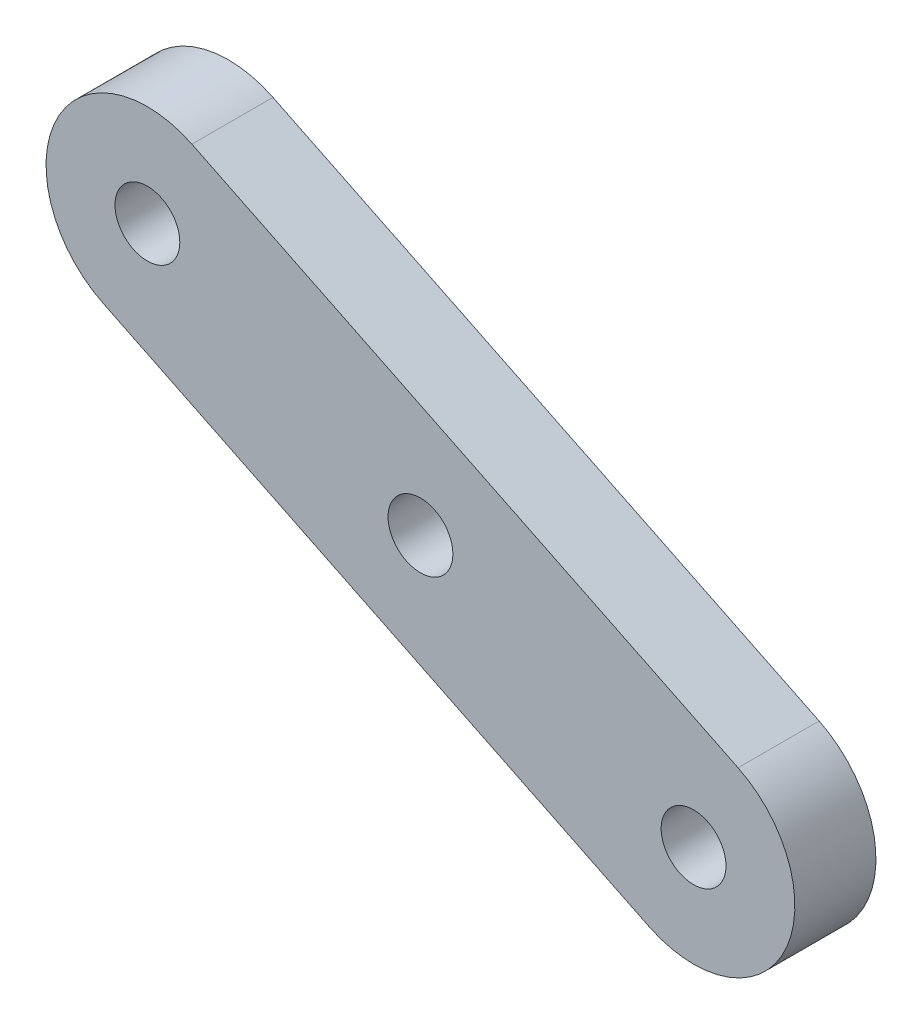
ISO-10303-21;
HEADER;
FILE_DESCRIPTION(('STEP AP214'),'2;1');
FILE_NAME('part.step','',(''),(''),'','','');
FILE_SCHEMA(('AUTOMOTIVE_DESIGN { 1 0 10303 214 1 1 1 1 }'));
ENDSEC;
DATA;
#1=APPLICATION_CONTEXT('core data for automotive mechanical design processes');
#2=APPLICATION_PROTOCOL_DEFINITION('international standard','automotive_design',2000,#1);
#3=PRODUCT_CONTEXT('',#1,'mechanical');
#4=PRODUCT('Part','Part','',(#3));
#5=PRODUCT_RELATED_PRODUCT_CATEGORY('part','',(#4));
#6=PRODUCT_DEFINITION_FORMATION('','',#4);
#7=PRODUCT_DEFINITION_CONTEXT('part definition',#1,'design');
#8=PRODUCT_DEFINITION('design','',#6,#7);
#9=PRODUCT_DEFINITION_SHAPE('','',#8);
#10=(LENGTH_UNIT() NAMED_UNIT(*) SI_UNIT(.MILLI.,.METRE.));
#11=(NAMED_UNIT(*) PLANE_ANGLE_UNIT() SI_UNIT($,.RADIAN.));
#12=(NAMED_UNIT(*) SI_UNIT($,.STERADIAN.) SOLID_ANGLE_UNIT());
#13=UNCERTAINTY_MEASURE_WITH_UNIT(LENGTH_MEASURE(1.E-05),#10,'distance_accuracy_value','');
#14=(GEOMETRIC_REPRESENTATION_CONTEXT(3) GLOBAL_UNCERTAINTY_ASSIGNED_CONTEXT((#13)) GLOBAL_UNIT_ASSIGNED_CONTEXT((#10,
#11,#12)) REPRESENTATION_CONTEXT('',''));
#15=CARTESIAN_POINT('',(0.,0.,0.));
#16=DIRECTION('',(0.,0.,1.));
#17=DIRECTION('',(1.,0.,0.));
#18=AXIS2_PLACEMENT_3D('',#15,#16,#17);
#19=CARTESIAN_POINT('',(0.,0.,4.));
#20=DIRECTION('',(0.,0.,1.));
#21=DIRECTION('',(1.,0.,0.));
#22=AXIS2_PLACEMENT_3D('',#19,#20,#21);
#23=PLANE('',#22);
#24=CARTESIAN_POINT('',(0.,0.,4.));
#25=DIRECTION('',(0.,0.,1.));
#26=DIRECTION('',(1.,0.,0.));
#27=AXIS2_PLACEMENT_3D('',#24,#25,#26);
#28=CIRCLE('',#27,1.6);
#29=CARTESIAN_POINT('',(1.60000000000001,0.,4.));
#30=VERTEX_POINT('',#29);
#31=EDGE_CURVE('E119',#30,#30,#28,.T.);
#32=ORIENTED_EDGE('',*,*,#31,.F.);
#33=EDGE_LOOP('',(#32));
#34=FACE_BOUND('',#33,.T.);
#35=CARTESIAN_POINT('',(0.,0.,4.));
#36=DIRECTION('',(0.,0.,1.));
#37=DIRECTION('',(1.,0.,0.));
#38=AXIS2_PLACEMENT_3D('',#35,#36,#37);
#39=CIRCLE('',#38,5.);
#40=CARTESIAN_POINT('',(-2.19568936266241,-4.4920984208598,4.));
#41=VERTEX_POINT('',#40);
#42=CARTESIAN_POINT('',(2.19568936266242,4.4920984208598,4.));
#43=VERTEX_POINT('',#42);
#44=EDGE_CURVE('E89',#41,#43,#39,.T.);
#45=ORIENTED_EDGE('',*,*,#44,.T.);
#46=DIRECTION('',(-0.89841968417196,0.439137872532483,0.));
#47=VECTOR('',#46,1.);
#48=CARTESIAN_POINT('',(2.19568936266242,4.4920984208598,4.));
#49=LINE('',#48,#47);
#50=CARTESIAN_POINT('',(-24.7569011624964,17.6662345968343,4.));
#51=VERTEX_POINT('',#50);
#52=EDGE_CURVE('E84',#43,#51,#49,.T.);
#53=ORIENTED_EDGE('',*,*,#52,.T.);
#54=CARTESIAN_POINT('',(-26.9525905251588,13.1741361759745,4.));
#55=DIRECTION('',(0.,0.,1.));
#56=DIRECTION('',(1.,0.,0.));
#57=AXIS2_PLACEMENT_3D('',#54,#55,#56);
#58=CIRCLE('',#57,5.);
#59=CARTESIAN_POINT('',(-29.1482798878212,8.68203775511468,4.));
#60=VERTEX_POINT('',#59);
#61=EDGE_CURVE('E87',#51,#60,#58,.T.);
#62=ORIENTED_EDGE('',*,*,#61,.T.);
#63=DIRECTION('',(0.89841968417196,-0.439137872532483,0.));
#64=VECTOR('',#63,1.);
#65=CARTESIAN_POINT('',(-2.19568936266241,-4.4920984208598,4.));
#66=LINE('',#65,#64);
#67=EDGE_CURVE('E54',#60,#41,#66,.T.);
#68=ORIENTED_EDGE('',*,*,#67,.T.);
#69=EDGE_LOOP('',(#45,#53,#62,#68));
#70=FACE_BOUND('',#69,.T.);
#71=CARTESIAN_POINT('',(-26.9525905251588,13.1741361759745,4.));
#72=DIRECTION('',(0.,0.,1.));
#73=DIRECTION('',(1.,0.,0.));
#74=AXIS2_PLACEMENT_3D('',#71,#72,#73);
#75=CIRCLE('',#74,1.6);
#76=CARTESIAN_POINT('',(-25.3525905251588,13.1741361759745,4.));
#77=VERTEX_POINT('',#76);
#78=EDGE_CURVE('E104',#77,#77,#75,.T.);
#79=ORIENTED_EDGE('',*,*,#78,.F.);
#80=EDGE_LOOP('',(#79));
#81=FACE_BOUND('',#80,.T.);
#82=CARTESIAN_POINT('',(-13.4762952625794,6.58706808798724,4.));
#83=DIRECTION('',(0.,0.,1.));
#84=DIRECTION('',(1.,0.,0.));
#85=AXIS2_PLACEMENT_3D('',#82,#83,#84);
#86=CIRCLE('',#85,1.6);
#87=CARTESIAN_POINT('',(-11.8762952625794,6.58706808798724,4.));
#88=VERTEX_POINT('',#87);
#89=EDGE_CURVE('E125',#88,#88,#86,.T.);
#90=ORIENTED_EDGE('',*,*,#89,.F.);
#91=EDGE_LOOP('',(#90));
#92=FACE_BOUND('',#91,.T.);
#93=ADVANCED_FACE('F37',(#34,#70,#81,#92),#23,.T.);
#94=CARTESIAN_POINT('',(0.,0.,0.));
#95=DIRECTION('',(0.,0.,1.));
#96=DIRECTION('',(1.,0.,0.));
#97=AXIS2_PLACEMENT_3D('',#94,#95,#96);
#98=PLANE('',#97);
#99=CARTESIAN_POINT('',(0.,0.,0.));
#100=DIRECTION('',(0.,0.,1.));
#101=DIRECTION('',(1.,0.,0.));
#102=AXIS2_PLACEMENT_3D('',#99,#100,#101);
#103=CIRCLE('',#102,5.);
#104=CARTESIAN_POINT('',(-2.19568936266241,-4.4920984208598,0.));
#105=VERTEX_POINT('',#104);
#106=CARTESIAN_POINT('',(2.19568936266242,4.4920984208598,0.));
#107=VERTEX_POINT('',#106);
#108=EDGE_CURVE('E101',#105,#107,#103,.T.);
#109=ORIENTED_EDGE('',*,*,#108,.F.);
#110=DIRECTION('',(0.89841968417196,-0.439137872532483,0.));
#111=VECTOR('',#110,1.);
#112=CARTESIAN_POINT('',(-2.19568936266241,-4.4920984208598,0.));
#113=LINE('',#112,#111);
#114=CARTESIAN_POINT('',(-29.1482798878212,8.68203775511468,0.));
#115=VERTEX_POINT('',#114);
#116=EDGE_CURVE('E77',#115,#105,#113,.T.);
#117=ORIENTED_EDGE('',*,*,#116,.F.);
#118=CARTESIAN_POINT('',(-26.9525905251588,13.1741361759745,0.));
#119=DIRECTION('',(0.,0.,1.));
#120=DIRECTION('',(1.,0.,0.));
#121=AXIS2_PLACEMENT_3D('',#118,#119,#120);
#122=CIRCLE('',#121,5.);
#123=CARTESIAN_POINT('',(-24.7569011624964,17.6662345968343,0.));
#124=VERTEX_POINT('',#123);
#125=EDGE_CURVE('E71',#124,#115,#122,.T.);
#126=ORIENTED_EDGE('',*,*,#125,.F.);
#127=DIRECTION('',(-0.89841968417196,0.439137872532483,0.));
#128=VECTOR('',#127,1.);
#129=CARTESIAN_POINT('',(2.19568936266242,4.4920984208598,0.));
#130=LINE('',#129,#128);
#131=EDGE_CURVE('E93',#107,#124,#130,.T.);
#132=ORIENTED_EDGE('',*,*,#131,.F.);
#133=EDGE_LOOP('',(#109,#117,#126,#132));
#134=FACE_BOUND('',#133,.T.);
#135=CARTESIAN_POINT('',(-26.9525905251588,13.1741361759745,0.));
#136=DIRECTION('',(0.,0.,1.));
#137=DIRECTION('',(1.,0.,0.));
#138=AXIS2_PLACEMENT_3D('',#135,#136,#137);
#139=CIRCLE('',#138,1.6);
#140=CARTESIAN_POINT('',(-25.3525905251588,13.1741361759745,0.));
#141=VERTEX_POINT('',#140);
#142=EDGE_CURVE('E116',#141,#141,#139,.T.);
#143=ORIENTED_EDGE('',*,*,#142,.T.);
#144=EDGE_LOOP('',(#143));
#145=FACE_BOUND('',#144,.T.);
#146=CARTESIAN_POINT('',(0.,0.,0.));
#147=DIRECTION('',(0.,0.,1.));
#148=DIRECTION('',(1.,0.,0.));
#149=AXIS2_PLACEMENT_3D('',#146,#147,#148);
#150=CIRCLE('',#149,1.6);
#151=CARTESIAN_POINT('',(1.60000000000001,0.,0.));
#152=VERTEX_POINT('',#151);
#153=EDGE_CURVE('E122',#152,#152,#150,.T.);
#154=ORIENTED_EDGE('',*,*,#153,.T.);
#155=EDGE_LOOP('',(#154));
#156=FACE_BOUND('',#155,.T.);
#157=CARTESIAN_POINT('',(-13.4762952625794,6.58706808798724,0.));
#158=DIRECTION('',(0.,0.,1.));
#159=DIRECTION('',(1.,0.,0.));
#160=AXIS2_PLACEMENT_3D('',#157,#158,#159);
#161=CIRCLE('',#160,1.6);
#162=CARTESIAN_POINT('',(-11.8762952625794,6.58706808798724,0.));
#163=VERTEX_POINT('',#162);
#164=EDGE_CURVE('E128',#163,#163,#161,.T.);
#165=ORIENTED_EDGE('',*,*,#164,.T.);
#166=EDGE_LOOP('',(#165));
#167=FACE_BOUND('',#166,.T.);
#168=ADVANCED_FACE('F112',(#134,#145,#156,#167),#98,.F.);
#169=CARTESIAN_POINT('',(0.,0.,4.));
#170=DIRECTION('',(0.,0.,-1.));
#171=DIRECTION('',(-1.,0.,0.));
#172=AXIS2_PLACEMENT_3D('',#169,#170,#171);
#173=CYLINDRICAL_SURFACE('',#172,5.);
#174=ORIENTED_EDGE('',*,*,#108,.T.);
#175=DIRECTION('',(0.,0.,-1.));
#176=VECTOR('',#175,1.);
#177=CARTESIAN_POINT('',(2.19568936266242,4.4920984208598,4.));
#178=LINE('',#177,#176);
#179=EDGE_CURVE('E11',#43,#107,#178,.T.);
#180=ORIENTED_EDGE('',*,*,#179,.F.);
#181=ORIENTED_EDGE('',*,*,#44,.F.);
#182=DIRECTION('',(0.,0.,-1.));
#183=VECTOR('',#182,1.);
#184=CARTESIAN_POINT('',(-2.19568936266241,-4.4920984208598,4.));
#185=LINE('',#184,#183);
#186=EDGE_CURVE('E97',#41,#105,#185,.T.);
#187=ORIENTED_EDGE('',*,*,#186,.T.);
#188=EDGE_LOOP('',(#174,#180,#181,#187));
#189=FACE_BOUND('',#188,.T.);
#190=ADVANCED_FACE('F39',(#189),#173,.T.);
#191=CARTESIAN_POINT('',(2.19568936266242,4.4920984208598,4.));
#192=DIRECTION('',(-0.439137872532483,-0.89841968417196,0.));
#193=DIRECTION('',(0.89841968417196,-0.439137872532483,0.));
#194=AXIS2_PLACEMENT_3D('',#191,#192,#193);
#195=PLANE('',#194);
#196=ORIENTED_EDGE('',*,*,#131,.T.);
#197=DIRECTION('',(0.,0.,-1.));
#198=VECTOR('',#197,1.);
#199=CARTESIAN_POINT('',(-24.7569011624964,17.6662345968343,4.));
#200=LINE('',#199,#198);
#201=EDGE_CURVE('E46',#51,#124,#200,.T.);
#202=ORIENTED_EDGE('',*,*,#201,.F.);
#203=ORIENTED_EDGE('',*,*,#52,.F.);
#204=ORIENTED_EDGE('',*,*,#179,.T.);
#205=EDGE_LOOP('',(#196,#202,#203,#204));
#206=FACE_BOUND('',#205,.T.);
#207=ADVANCED_FACE('F92',(#206),#195,.F.);
#208=CARTESIAN_POINT('',(-26.9525905251588,13.1741361759745,4.));
#209=DIRECTION('',(0.,0.,-1.));
#210=DIRECTION('',(-1.,0.,0.));
#211=AXIS2_PLACEMENT_3D('',#208,#209,#210);
#212=CYLINDRICAL_SURFACE('',#211,5.);
#213=ORIENTED_EDGE('',*,*,#125,.T.);
#214=DIRECTION('',(0.,0.,-1.));
#215=VECTOR('',#214,1.);
#216=CARTESIAN_POINT('',(-29.1482798878212,8.68203775511468,4.));
#217=LINE('',#216,#215);
#218=EDGE_CURVE('E94',#60,#115,#217,.T.);
#219=ORIENTED_EDGE('',*,*,#218,.F.);
#220=ORIENTED_EDGE('',*,*,#61,.F.);
#221=ORIENTED_EDGE('',*,*,#201,.T.);
#222=EDGE_LOOP('',(#213,#219,#220,#221));
#223=FACE_BOUND('',#222,.T.);
#224=ADVANCED_FACE('F95',(#223),#212,.T.);
#225=CARTESIAN_POINT('',(-2.19568936266241,-4.4920984208598,4.));
#226=DIRECTION('',(0.439137872532483,0.89841968417196,0.));
#227=DIRECTION('',(-0.89841968417196,0.439137872532483,0.));
#228=AXIS2_PLACEMENT_3D('',#225,#226,#227);
#229=PLANE('',#228);
#230=ORIENTED_EDGE('',*,*,#116,.T.);
#231=ORIENTED_EDGE('',*,*,#186,.F.);
#232=ORIENTED_EDGE('',*,*,#67,.F.);
#233=ORIENTED_EDGE('',*,*,#218,.T.);
#234=EDGE_LOOP('',(#230,#231,#232,#233));
#235=FACE_BOUND('',#234,.T.);
#236=ADVANCED_FACE('F109',(#235),#229,.F.);
#237=CARTESIAN_POINT('',(-26.9525905251588,13.1741361759745,4.));
#238=DIRECTION('',(0.,0.,-1.));
#239=DIRECTION('',(-1.,0.,0.));
#240=AXIS2_PLACEMENT_3D('',#237,#238,#239);
#241=CYLINDRICAL_SURFACE('',#240,1.6);
#242=ORIENTED_EDGE('',*,*,#78,.T.);
#243=EDGE_LOOP('',(#242));
#244=FACE_BOUND('',#243,.T.);
#245=ORIENTED_EDGE('',*,*,#142,.F.);
#246=EDGE_LOOP('',(#245));
#247=FACE_BOUND('',#246,.T.);
#248=ADVANCED_FACE('F146',(#244,#247),#241,.F.);
#249=CARTESIAN_POINT('',(0.,0.,4.));
#250=DIRECTION('',(0.,0.,-1.));
#251=DIRECTION('',(-1.,0.,0.));
#252=AXIS2_PLACEMENT_3D('',#249,#250,#251);
#253=CYLINDRICAL_SURFACE('',#252,1.6);
#254=ORIENTED_EDGE('',*,*,#31,.T.);
#255=EDGE_LOOP('',(#254));
#256=FACE_BOUND('',#255,.T.);
#257=ORIENTED_EDGE('',*,*,#153,.F.);
#258=EDGE_LOOP('',(#257));
#259=FACE_BOUND('',#258,.T.);
#260=ADVANCED_FACE('F192',(#256,#259),#253,.F.);
#261=CARTESIAN_POINT('',(-13.4762952625794,6.58706808798724,4.));
#262=DIRECTION('',(0.,0.,-1.));
#263=DIRECTION('',(-1.,0.,0.));
#264=AXIS2_PLACEMENT_3D('',#261,#262,#263);
#265=CYLINDRICAL_SURFACE('',#264,1.6);
#266=ORIENTED_EDGE('',*,*,#89,.T.);
#267=EDGE_LOOP('',(#266));
#268=FACE_BOUND('',#267,.T.);
#269=ORIENTED_EDGE('',*,*,#164,.F.);
#270=EDGE_LOOP('',(#269));
#271=FACE_BOUND('',#270,.T.);
#272=ADVANCED_FACE('F134',(#268,#271),#265,.F.);
#273=CLOSED_SHELL('',(#93,#168,#190,#207,#224,#236,#248,#260,#272));
#274=MANIFOLD_SOLID_BREP('B2',#273);
#275=ADVANCED_BREP_SHAPE_REPRESENTATION('',(#18,#274),#14);
#276=SHAPE_DEFINITION_REPRESENTATION(#9,#275);
ENDSEC;
END-ISO-10303-21;
